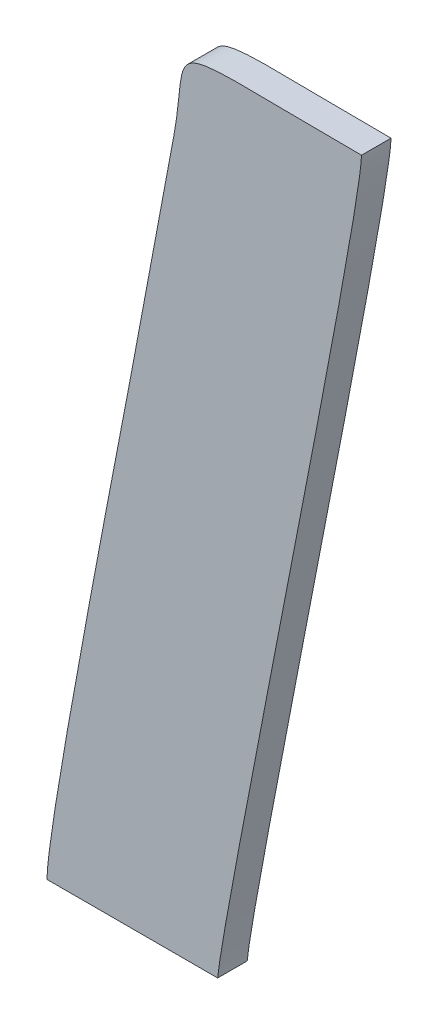
ISO-10303-21;
HEADER;
FILE_DESCRIPTION(('STEP AP214'),'2;1');
FILE_NAME('part.step','',(''),(''),'','','');
FILE_SCHEMA(('AUTOMOTIVE_DESIGN { 1 0 10303 214 1 1 1 1 }'));
ENDSEC;
DATA;
#1=APPLICATION_CONTEXT('core data for automotive mechanical design processes');
#2=APPLICATION_PROTOCOL_DEFINITION('international standard','automotive_design',2000,#1);
#3=PRODUCT_CONTEXT('',#1,'mechanical');
#4=PRODUCT('Part','Part','',(#3));
#5=PRODUCT_RELATED_PRODUCT_CATEGORY('part','',(#4));
#6=PRODUCT_DEFINITION_FORMATION('','',#4);
#7=PRODUCT_DEFINITION_CONTEXT('part definition',#1,'design');
#8=PRODUCT_DEFINITION('design','',#6,#7);
#9=PRODUCT_DEFINITION_SHAPE('','',#8);
#10=(LENGTH_UNIT() NAMED_UNIT(*) SI_UNIT(.MILLI.,.METRE.));
#11=(NAMED_UNIT(*) PLANE_ANGLE_UNIT() SI_UNIT($,.RADIAN.));
#12=(NAMED_UNIT(*) SI_UNIT($,.STERADIAN.) SOLID_ANGLE_UNIT());
#13=UNCERTAINTY_MEASURE_WITH_UNIT(LENGTH_MEASURE(1.E-05),#10,'distance_accuracy_value','');
#14=(GEOMETRIC_REPRESENTATION_CONTEXT(3) GLOBAL_UNCERTAINTY_ASSIGNED_CONTEXT((#13)) GLOBAL_UNIT_ASSIGNED_CONTEXT((#10,
#11,#12)) REPRESENTATION_CONTEXT('',''));
#15=CARTESIAN_POINT('',(0.,0.,0.));
#16=DIRECTION('',(0.,0.,1.));
#17=DIRECTION('',(1.,0.,0.));
#18=AXIS2_PLACEMENT_3D('',#15,#16,#17);
#19=CARTESIAN_POINT('',(50.0798719999998,11.254477,0.001));
#20=CARTESIAN_POINT('',(50.0798719999998,11.254477,0.));
#21=CARTESIAN_POINT('',(50.0793819999998,11.251789,0.001));
#22=CARTESIAN_POINT('',(50.0793819999998,11.251789,0.));
#23=CARTESIAN_POINT('',(50.0788639999998,11.249129,0.001));
#24=CARTESIAN_POINT('',(50.0788639999998,11.249129,0.));
#25=CARTESIAN_POINT('',(50.0783739999998,11.246483,0.001));
#26=CARTESIAN_POINT('',(50.0783739999998,11.246483,0.));
#27=B_SPLINE_SURFACE_WITH_KNOTS('',3,1,((#19,#20),(#21,#22),(#23,#24),(#25,#26)),.UNSPECIFIED.,
.F.,.F.,.F.,(4,4),(2,2),(0.5,0.666666666666667),(0.,1.),.UNSPECIFIED.);
#28=CARTESIAN_POINT('',(50.0798719999998,11.254477,0.));
#29=CARTESIAN_POINT('',(50.0793819999998,11.251789,0.));
#30=CARTESIAN_POINT('',(50.0788639999998,11.249129,0.));
#31=CARTESIAN_POINT('',(50.0783739999998,11.246483,0.));
#32=B_SPLINE_CURVE_WITH_KNOTS('',3,(#28,#29,#30,#31),.UNSPECIFIED.,.F.,.F.,(4,4),(0.5,
0.666666666666667),.UNSPECIFIED.);
#33=CARTESIAN_POINT('',(50.0798719999998,11.254477,0.));
#34=VERTEX_POINT('',#33);
#35=CARTESIAN_POINT('',(50.0783739999998,11.246483,0.));
#36=VERTEX_POINT('',#35);
#37=EDGE_CURVE('E11',#34,#36,#32,.T.);
#38=DIRECTION('',(0.,0.,-1.));
#39=VECTOR('',#38,1.);
#40=CARTESIAN_POINT('',(50.0783739999998,11.246483,0.001));
#41=LINE('',#40,#39);
#42=CARTESIAN_POINT('',(50.0783739999998,11.246483,0.001));
#43=VERTEX_POINT('',#42);
#44=EDGE_CURVE('E28',#43,#36,#41,.T.);
#45=CARTESIAN_POINT('',(50.0798719999998,11.254477,0.001));
#46=CARTESIAN_POINT('',(50.0793819999998,11.251789,0.001));
#47=CARTESIAN_POINT('',(50.0788639999998,11.249129,0.001));
#48=CARTESIAN_POINT('',(50.0783739999998,11.246483,0.001));
#49=B_SPLINE_CURVE_WITH_KNOTS('',3,(#45,#46,#47,#48),.UNSPECIFIED.,.F.,.F.,(4,4),(0.5,
0.666666666666667),.UNSPECIFIED.);
#50=CARTESIAN_POINT('',(50.0798719999998,11.254477,0.001));
#51=VERTEX_POINT('',#50);
#52=EDGE_CURVE('E135',#51,#43,#49,.T.);
#53=DIRECTION('',(0.,0.,-1.));
#54=VECTOR('',#53,1.);
#55=CARTESIAN_POINT('',(50.0798719999998,11.254477,0.001));
#56=LINE('',#55,#54);
#57=EDGE_CURVE('E40',#51,#34,#56,.T.);
#58=ORIENTED_EDGE('',*,*,#37,.T.);
#59=ORIENTED_EDGE('',*,*,#44,.F.);
#60=ORIENTED_EDGE('',*,*,#52,.F.);
#61=ORIENTED_EDGE('',*,*,#57,.T.);
#62=EDGE_LOOP('',(#58,#59,#60,#61));
#63=FACE_BOUND('',#62,.T.);
#64=ADVANCED_FACE('F17',(#63),#27,.F.);
#65=CARTESIAN_POINT('',(50.0783739999998,11.246483,0.001));
#66=CARTESIAN_POINT('',(50.0783739999998,11.246483,0.));
#67=CARTESIAN_POINT('',(50.0778839999998,11.243921,0.001));
#68=CARTESIAN_POINT('',(50.0778839999998,11.243921,0.));
#69=CARTESIAN_POINT('',(50.0755739999998,11.232133,0.001));
#70=CARTESIAN_POINT('',(50.0755739999998,11.232133,0.));
#71=CARTESIAN_POINT('',(50.0755739999998,11.230509,0.001));
#72=CARTESIAN_POINT('',(50.0755739999998,11.230509,0.));
#73=B_SPLINE_SURFACE_WITH_KNOTS('',3,1,((#65,#66),(#67,#68),(#69,#70),(#71,#72)),.UNSPECIFIED.,
.F.,.F.,.F.,(4,4),(2,2),(0.666666666666667,1.),(0.,1.),.UNSPECIFIED.);
#74=CARTESIAN_POINT('',(50.0783739999998,11.246483,0.));
#75=CARTESIAN_POINT('',(50.0778839999998,11.243921,0.));
#76=CARTESIAN_POINT('',(50.0755739999998,11.232133,0.));
#77=CARTESIAN_POINT('',(50.0755739999998,11.230509,0.));
#78=B_SPLINE_CURVE_WITH_KNOTS('',3,(#74,#75,#76,#77),.UNSPECIFIED.,.F.,.F.,(4,4),
(0.666666666666667,1.),.UNSPECIFIED.);
#79=CARTESIAN_POINT('',(50.0755739999998,11.230509,0.));
#80=VERTEX_POINT('',#79);
#81=EDGE_CURVE('E127',#36,#80,#78,.T.);
#82=DIRECTION('',(0.,0.,-1.));
#83=VECTOR('',#82,1.);
#84=CARTESIAN_POINT('',(50.0755739999998,11.230509,0.001));
#85=LINE('',#84,#83);
#86=CARTESIAN_POINT('',(50.0755739999998,11.230509,0.001));
#87=VERTEX_POINT('',#86);
#88=EDGE_CURVE('E122',#87,#80,#85,.T.);
#89=CARTESIAN_POINT('',(50.0783739999998,11.246483,0.001));
#90=CARTESIAN_POINT('',(50.0778839999998,11.243921,0.001));
#91=CARTESIAN_POINT('',(50.0755739999998,11.232133,0.001));
#92=CARTESIAN_POINT('',(50.0755739999998,11.230509,0.001));
#93=B_SPLINE_CURVE_WITH_KNOTS('',3,(#89,#90,#91,#92),.UNSPECIFIED.,.F.,.F.,(4,4),
(0.666666666666667,1.),.UNSPECIFIED.);
#94=EDGE_CURVE('E118',#43,#87,#93,.T.);
#95=ORIENTED_EDGE('',*,*,#81,.T.);
#96=ORIENTED_EDGE('',*,*,#88,.F.);
#97=ORIENTED_EDGE('',*,*,#94,.F.);
#98=ORIENTED_EDGE('',*,*,#44,.T.);
#99=EDGE_LOOP('',(#95,#96,#97,#98));
#100=FACE_BOUND('',#99,.T.);
#101=ADVANCED_FACE('F143',(#100),#73,.F.);
#102=CARTESIAN_POINT('',(0.,11.230509,0.001));
#103=DIRECTION('',(0.,1.,0.));
#104=DIRECTION('',(0.,0.,1.));
#105=AXIS2_PLACEMENT_3D('',#102,#103,#104);
#106=PLANE('',#105);
#107=DIRECTION('',(1.,0.,0.));
#108=VECTOR('',#107,1.);
#109=CARTESIAN_POINT('',(0.,11.230509,0.));
#110=LINE('',#109,#108);
#111=CARTESIAN_POINT('',(50.0813559999998,11.230509,0.));
#112=VERTEX_POINT('',#111);
#113=EDGE_CURVE('E116',#80,#112,#110,.T.);
#114=ORIENTED_EDGE('',*,*,#113,.T.);
#115=DIRECTION('',(0.,0.,-1.));
#116=VECTOR('',#115,1.);
#117=CARTESIAN_POINT('',(50.0813559999998,11.230509,0.001));
#118=LINE('',#117,#116);
#119=CARTESIAN_POINT('',(50.0813559999998,11.230509,0.001));
#120=VERTEX_POINT('',#119);
#121=EDGE_CURVE('E114',#120,#112,#118,.T.);
#122=ORIENTED_EDGE('',*,*,#121,.F.);
#123=DIRECTION('',(1.,0.,0.));
#124=VECTOR('',#123,1.);
#125=CARTESIAN_POINT('',(0.,11.230509,0.001));
#126=LINE('',#125,#124);
#127=EDGE_CURVE('E74',#87,#120,#126,.T.);
#128=ORIENTED_EDGE('',*,*,#127,.F.);
#129=ORIENTED_EDGE('',*,*,#88,.T.);
#130=EDGE_LOOP('',(#114,#122,#128,#129));
#131=FACE_BOUND('',#130,.T.);
#132=ADVANCED_FACE('F146',(#131),#106,.F.);
#133=CARTESIAN_POINT('',(50.0813559999998,11.230509,0.001));
#134=CARTESIAN_POINT('',(50.0813559999998,11.230509,0.));
#135=CARTESIAN_POINT('',(50.0815379999998,11.232651,0.001));
#136=CARTESIAN_POINT('',(50.0815379999998,11.232651,0.));
#137=CARTESIAN_POINT('',(50.0861859999998,11.255079,0.001));
#138=CARTESIAN_POINT('',(50.0861859999998,11.255079,0.));
#139=CARTESIAN_POINT('',(50.0862279999998,11.257081,0.001));
#140=CARTESIAN_POINT('',(50.0862279999998,11.257081,0.));
#141=B_SPLINE_SURFACE_WITH_KNOTS('',3,1,((#133,#134),(#135,#136),(#137,#138),(#139,#140)),
.UNSPECIFIED.,.F.,.F.,.F.,(4,4),(2,2),(0.166666666666667,0.333333333333333),(0.,1.),.UNSPECIFIED.);
#142=CARTESIAN_POINT('',(50.0813559999998,11.230509,0.));
#143=CARTESIAN_POINT('',(50.0815379999998,11.232651,0.));
#144=CARTESIAN_POINT('',(50.0861859999998,11.255079,0.));
#145=CARTESIAN_POINT('',(50.0862279999998,11.257081,0.));
#146=B_SPLINE_CURVE_WITH_KNOTS('',3,(#142,#143,#144,#145),.UNSPECIFIED.,.F.,.F.,(4,4),
(0.166666666666667,0.333333333333333),.UNSPECIFIED.);
#147=CARTESIAN_POINT('',(50.0862279999998,11.257081,0.));
#148=VERTEX_POINT('',#147);
#149=EDGE_CURVE('E83',#112,#148,#146,.T.);
#150=DIRECTION('',(0.,0.,-1.));
#151=VECTOR('',#150,1.);
#152=CARTESIAN_POINT('',(50.0862279999998,11.257081,0.001));
#153=LINE('',#152,#151);
#154=CARTESIAN_POINT('',(50.0862279999998,11.257081,0.001));
#155=VERTEX_POINT('',#154);
#156=EDGE_CURVE('E77',#155,#148,#153,.T.);
#157=CARTESIAN_POINT('',(50.0813559999998,11.230509,0.001));
#158=CARTESIAN_POINT('',(50.0815379999998,11.232651,0.001));
#159=CARTESIAN_POINT('',(50.0861859999998,11.255079,0.001));
#160=CARTESIAN_POINT('',(50.0862279999998,11.257081,0.001));
#161=B_SPLINE_CURVE_WITH_KNOTS('',3,(#157,#158,#159,#160),.UNSPECIFIED.,.F.,.F.,(4,4),
(0.166666666666667,0.333333333333333),.UNSPECIFIED.);
#162=EDGE_CURVE('E68',#120,#155,#161,.T.);
#163=ORIENTED_EDGE('',*,*,#149,.T.);
#164=ORIENTED_EDGE('',*,*,#156,.F.);
#165=ORIENTED_EDGE('',*,*,#162,.F.);
#166=ORIENTED_EDGE('',*,*,#121,.T.);
#167=EDGE_LOOP('',(#163,#164,#165,#166));
#168=FACE_BOUND('',#167,.T.);
#169=ADVANCED_FACE('F81',(#168),#141,.F.);
#170=CARTESIAN_POINT('',(50.0862279999998,11.257081,0.001));
#171=CARTESIAN_POINT('',(50.0862279999998,11.257081,0.));
#172=CARTESIAN_POINT('',(50.0790319999998,11.257081,0.001));
#173=CARTESIAN_POINT('',(50.0790319999998,11.257081,0.));
#174=CARTESIAN_POINT('',(50.0804599999998,11.257613,0.001));
#175=CARTESIAN_POINT('',(50.0804599999998,11.257613,0.));
#176=CARTESIAN_POINT('',(50.0798719999998,11.254477,0.001));
#177=CARTESIAN_POINT('',(50.0798719999998,11.254477,0.));
#178=B_SPLINE_SURFACE_WITH_KNOTS('',3,1,((#170,#171),(#172,#173),(#174,#175),(#176,#177)),
.UNSPECIFIED.,.F.,.F.,.F.,(4,4),(2,2),(0.333333333333333,0.5),(0.,1.),.UNSPECIFIED.);
#179=CARTESIAN_POINT('',(50.0862279999998,11.257081,0.));
#180=CARTESIAN_POINT('',(50.0790319999998,11.257081,0.));
#181=CARTESIAN_POINT('',(50.0804599999998,11.257613,0.));
#182=CARTESIAN_POINT('',(50.0798719999998,11.254477,0.));
#183=B_SPLINE_CURVE_WITH_KNOTS('',3,(#179,#180,#181,#182),.UNSPECIFIED.,.F.,.F.,(4,4),
(0.333333333333333,0.5),.UNSPECIFIED.);
#184=EDGE_CURVE('E78',#148,#34,#183,.T.);
#185=CARTESIAN_POINT('',(50.0862279999998,11.257081,0.001));
#186=CARTESIAN_POINT('',(50.0790319999998,11.257081,0.001));
#187=CARTESIAN_POINT('',(50.0804599999998,11.257613,0.001));
#188=CARTESIAN_POINT('',(50.0798719999998,11.254477,0.001));
#189=B_SPLINE_CURVE_WITH_KNOTS('',3,(#185,#186,#187,#188),.UNSPECIFIED.,.F.,.F.,(4,4),
(0.333333333333333,0.5),.UNSPECIFIED.);
#190=EDGE_CURVE('E72',#155,#51,#189,.T.);
#191=ORIENTED_EDGE('',*,*,#184,.T.);
#192=ORIENTED_EDGE('',*,*,#57,.F.);
#193=ORIENTED_EDGE('',*,*,#190,.F.);
#194=ORIENTED_EDGE('',*,*,#156,.T.);
#195=EDGE_LOOP('',(#191,#192,#193,#194));
#196=FACE_BOUND('',#195,.T.);
#197=ADVANCED_FACE('F88',(#196),#178,.F.);
#198=CARTESIAN_POINT('',(0.,0.,0.001));
#199=DIRECTION('',(0.,0.,1.));
#200=DIRECTION('',(1.,0.,0.));
#201=AXIS2_PLACEMENT_3D('',#198,#199,#200);
#202=PLANE('',#201);
#203=ORIENTED_EDGE('',*,*,#52,.T.);
#204=ORIENTED_EDGE('',*,*,#94,.T.);
#205=ORIENTED_EDGE('',*,*,#127,.T.);
#206=ORIENTED_EDGE('',*,*,#162,.T.);
#207=ORIENTED_EDGE('',*,*,#190,.T.);
#208=EDGE_LOOP('',(#203,#204,#205,#206,#207));
#209=FACE_BOUND('',#208,.T.);
#210=ADVANCED_FACE('F70',(#209),#202,.T.);
#211=CARTESIAN_POINT('',(0.,0.,0.));
#212=DIRECTION('',(0.,0.,1.));
#213=DIRECTION('',(1.,0.,0.));
#214=AXIS2_PLACEMENT_3D('',#211,#212,#213);
#215=PLANE('',#214);
#216=ORIENTED_EDGE('',*,*,#37,.F.);
#217=ORIENTED_EDGE('',*,*,#184,.F.);
#218=ORIENTED_EDGE('',*,*,#149,.F.);
#219=ORIENTED_EDGE('',*,*,#113,.F.);
#220=ORIENTED_EDGE('',*,*,#81,.F.);
#221=EDGE_LOOP('',(#216,#217,#218,#219,#220));
#222=FACE_BOUND('',#221,.T.);
#223=ADVANCED_FACE('F148',(#222),#215,.F.);
#224=CLOSED_SHELL('',(#64,#101,#132,#169,#197,#210,#223));
#225=MANIFOLD_SOLID_BREP('B1',#224);
#226=ADVANCED_BREP_SHAPE_REPRESENTATION('',(#18,#225),#14);
#227=SHAPE_DEFINITION_REPRESENTATION(#9,#226);
ENDSEC;
END-ISO-10303-21;
